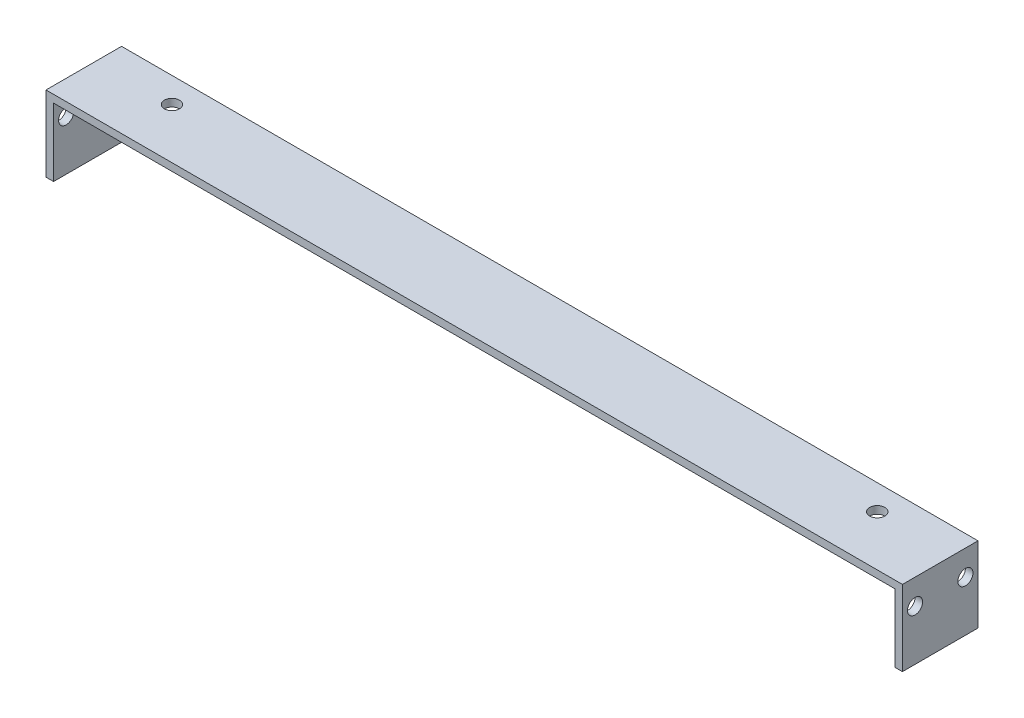
ISO-10303-21;
HEADER;
FILE_DESCRIPTION(('STEP AP214'),'2;1');
FILE_NAME('part.step','',(''),(''),'','','');
FILE_SCHEMA(('AUTOMOTIVE_DESIGN { 1 0 10303 214 1 1 1 1 }'));
ENDSEC;
DATA;
#1=APPLICATION_CONTEXT('core data for automotive mechanical design processes');
#2=APPLICATION_PROTOCOL_DEFINITION('international standard','automotive_design',2000,#1);
#3=PRODUCT_CONTEXT('',#1,'mechanical');
#4=PRODUCT('Part','Part','',(#3));
#5=PRODUCT_RELATED_PRODUCT_CATEGORY('part','',(#4));
#6=PRODUCT_DEFINITION_FORMATION('','',#4);
#7=PRODUCT_DEFINITION_CONTEXT('part definition',#1,'design');
#8=PRODUCT_DEFINITION('design','',#6,#7);
#9=PRODUCT_DEFINITION_SHAPE('','',#8);
#10=(LENGTH_UNIT() NAMED_UNIT(*) SI_UNIT(.MILLI.,.METRE.));
#11=(NAMED_UNIT(*) PLANE_ANGLE_UNIT() SI_UNIT($,.RADIAN.));
#12=(NAMED_UNIT(*) SI_UNIT($,.STERADIAN.) SOLID_ANGLE_UNIT());
#13=UNCERTAINTY_MEASURE_WITH_UNIT(LENGTH_MEASURE(1.E-05),#10,'distance_accuracy_value','');
#14=(GEOMETRIC_REPRESENTATION_CONTEXT(3) GLOBAL_UNCERTAINTY_ASSIGNED_CONTEXT((#13)) GLOBAL_UNIT_ASSIGNED_CONTEXT((#10,
#11,#12)) REPRESENTATION_CONTEXT('',''));
#15=CARTESIAN_POINT('',(0.,0.,0.));
#16=DIRECTION('',(0.,0.,1.));
#17=DIRECTION('',(1.,0.,0.));
#18=AXIS2_PLACEMENT_3D('',#15,#16,#17);
#19=CARTESIAN_POINT('',(0.,1.5,0.));
#20=DIRECTION('',(0.,-1.,0.));
#21=DIRECTION('',(0.,0.,-1.));
#22=AXIS2_PLACEMENT_3D('',#19,#20,#21);
#23=PLANE('',#22);
#24=CARTESIAN_POINT('',(13.5,1.50000000000006,-10.));
#25=DIRECTION('',(0.,-1.,0.));
#26=DIRECTION('',(0.,0.,-1.));
#27=AXIS2_PLACEMENT_3D('',#24,#25,#26);
#28=CIRCLE('',#27,1.5);
#29=CARTESIAN_POINT('',(13.5,1.50000000000006,-11.5));
#30=VERTEX_POINT('',#29);
#31=EDGE_CURVE('E262',#30,#30,#28,.F.);
#32=ORIENTED_EDGE('',*,*,#31,.F.);
#33=EDGE_LOOP('',(#32));
#34=FACE_BOUND('',#33,.T.);
#35=DIRECTION('',(-1.,0.,0.));
#36=VECTOR('',#35,1.);
#37=CARTESIAN_POINT('',(0.,1.5,-15.));
#38=LINE('',#37,#36);
#39=CARTESIAN_POINT('',(168.5,1.5,-15.));
#40=VERTEX_POINT('',#39);
#41=CARTESIAN_POINT('',(-1.5,1.5,-15.));
#42=VERTEX_POINT('',#41);
#43=EDGE_CURVE('E11',#40,#42,#38,.T.);
#44=ORIENTED_EDGE('',*,*,#43,.T.);
#45=DIRECTION('',(0.,0.,-1.));
#46=VECTOR('',#45,1.);
#47=CARTESIAN_POINT('',(-1.5,1.5,0.));
#48=LINE('',#47,#46);
#49=CARTESIAN_POINT('',(-1.5,1.5,0.));
#50=VERTEX_POINT('',#49);
#51=EDGE_CURVE('E110',#50,#42,#48,.T.);
#52=ORIENTED_EDGE('',*,*,#51,.F.);
#53=DIRECTION('',(1.,0.,0.));
#54=VECTOR('',#53,1.);
#55=CARTESIAN_POINT('',(0.,1.5,0.));
#56=LINE('',#55,#54);
#57=CARTESIAN_POINT('',(168.5,1.5,0.));
#58=VERTEX_POINT('',#57);
#59=EDGE_CURVE('E42',#50,#58,#56,.T.);
#60=ORIENTED_EDGE('',*,*,#59,.T.);
#61=DIRECTION('',(0.,0.,1.));
#62=VECTOR('',#61,1.);
#63=CARTESIAN_POINT('',(168.5,1.5,0.));
#64=LINE('',#63,#62);
#65=EDGE_CURVE('E149',#40,#58,#64,.T.);
#66=ORIENTED_EDGE('',*,*,#65,.F.);
#67=EDGE_LOOP('',(#44,#52,#60,#66));
#68=FACE_BOUND('',#67,.T.);
#69=CARTESIAN_POINT('',(153.5,1.50000000000006,-10.));
#70=DIRECTION('',(0.,-1.,0.));
#71=DIRECTION('',(0.,0.,-1.));
#72=AXIS2_PLACEMENT_3D('',#69,#70,#71);
#73=CIRCLE('',#72,1.5);
#74=CARTESIAN_POINT('',(153.5,1.50000000000006,-11.5));
#75=VERTEX_POINT('',#74);
#76=EDGE_CURVE('E258',#75,#75,#73,.F.);
#77=ORIENTED_EDGE('',*,*,#76,.F.);
#78=EDGE_LOOP('',(#77));
#79=FACE_BOUND('',#78,.T.);
#80=ADVANCED_FACE('F33',(#34,#68,#79),#23,.F.);
#81=CARTESIAN_POINT('',(0.,0.,0.));
#82=DIRECTION('',(0.,-1.,0.));
#83=DIRECTION('',(0.,0.,-1.));
#84=AXIS2_PLACEMENT_3D('',#81,#82,#83);
#85=PLANE('',#84);
#86=CARTESIAN_POINT('',(13.5,0.,-10.));
#87=DIRECTION('',(0.,-1.,0.));
#88=DIRECTION('',(0.,0.,-1.));
#89=AXIS2_PLACEMENT_3D('',#86,#87,#88);
#90=CIRCLE('',#89,1.5);
#91=CARTESIAN_POINT('',(13.5,0.,-11.5));
#92=VERTEX_POINT('',#91);
#93=EDGE_CURVE('E259',#92,#92,#90,.F.);
#94=ORIENTED_EDGE('',*,*,#93,.T.);
#95=EDGE_LOOP('',(#94));
#96=FACE_BOUND('',#95,.T.);
#97=DIRECTION('',(0.,0.,1.));
#98=VECTOR('',#97,1.);
#99=CARTESIAN_POINT('',(0.,0.,0.));
#100=LINE('',#99,#98);
#101=CARTESIAN_POINT('',(0.,0.,-15.));
#102=VERTEX_POINT('',#101);
#103=CARTESIAN_POINT('',(0.,0.,0.));
#104=VERTEX_POINT('',#103);
#105=EDGE_CURVE('E168',#102,#104,#100,.T.);
#106=ORIENTED_EDGE('',*,*,#105,.F.);
#107=DIRECTION('',(-1.,0.,0.));
#108=VECTOR('',#107,1.);
#109=CARTESIAN_POINT('',(0.,0.,-15.));
#110=LINE('',#109,#108);
#111=CARTESIAN_POINT('',(167.,0.,-15.));
#112=VERTEX_POINT('',#111);
#113=EDGE_CURVE('E50',#112,#102,#110,.T.);
#114=ORIENTED_EDGE('',*,*,#113,.F.);
#115=DIRECTION('',(0.,0.,-1.));
#116=VECTOR('',#115,1.);
#117=CARTESIAN_POINT('',(167.,0.,0.));
#118=LINE('',#117,#116);
#119=CARTESIAN_POINT('',(167.,0.,0.));
#120=VERTEX_POINT('',#119);
#121=EDGE_CURVE('E175',#120,#112,#118,.T.);
#122=ORIENTED_EDGE('',*,*,#121,.F.);
#123=DIRECTION('',(1.,0.,0.));
#124=VECTOR('',#123,1.);
#125=CARTESIAN_POINT('',(0.,0.,0.));
#126=LINE('',#125,#124);
#127=EDGE_CURVE('E58',#104,#120,#126,.T.);
#128=ORIENTED_EDGE('',*,*,#127,.F.);
#129=EDGE_LOOP('',(#106,#114,#122,#128));
#130=FACE_BOUND('',#129,.T.);
#131=CARTESIAN_POINT('',(153.5,0.,-10.));
#132=DIRECTION('',(0.,-1.,0.));
#133=DIRECTION('',(0.,0.,-1.));
#134=AXIS2_PLACEMENT_3D('',#131,#132,#133);
#135=CIRCLE('',#134,1.5);
#136=CARTESIAN_POINT('',(153.5,0.,-11.5));
#137=VERTEX_POINT('',#136);
#138=EDGE_CURVE('E37',#137,#137,#135,.F.);
#139=ORIENTED_EDGE('',*,*,#138,.T.);
#140=EDGE_LOOP('',(#139));
#141=FACE_BOUND('',#140,.T.);
#142=ADVANCED_FACE('F209',(#96,#130,#141),#85,.T.);
#143=CARTESIAN_POINT('',(167.,0.,0.));
#144=DIRECTION('',(1.,0.,0.));
#145=DIRECTION('',(0.,0.,-1.));
#146=AXIS2_PLACEMENT_3D('',#143,#144,#145);
#147=PLANE('',#146);
#148=CARTESIAN_POINT('',(167.,-3.5,-2.5));
#149=DIRECTION('',(1.,0.,0.));
#150=DIRECTION('',(0.,0.,-1.));
#151=AXIS2_PLACEMENT_3D('',#148,#149,#150);
#152=CIRCLE('',#151,1.5);
#153=CARTESIAN_POINT('',(167.,-3.5,-4.));
#154=VERTEX_POINT('',#153);
#155=EDGE_CURVE('E126',#154,#154,#152,.F.);
#156=ORIENTED_EDGE('',*,*,#155,.F.);
#157=EDGE_LOOP('',(#156));
#158=FACE_BOUND('',#157,.T.);
#159=DIRECTION('',(0.,-1.,0.));
#160=VECTOR('',#159,1.);
#161=CARTESIAN_POINT('',(167.,1.5,0.));
#162=LINE('',#161,#160);
#163=CARTESIAN_POINT('',(167.,-13.5,0.));
#164=VERTEX_POINT('',#163);
#165=EDGE_CURVE('E157',#120,#164,#162,.T.);
#166=ORIENTED_EDGE('',*,*,#165,.F.);
#167=ORIENTED_EDGE('',*,*,#121,.T.);
#168=DIRECTION('',(0.,1.,0.));
#169=VECTOR('',#168,1.);
#170=CARTESIAN_POINT('',(167.,1.5,-15.));
#171=LINE('',#170,#169);
#172=CARTESIAN_POINT('',(167.,-13.5,-15.));
#173=VERTEX_POINT('',#172);
#174=EDGE_CURVE('E144',#173,#112,#171,.T.);
#175=ORIENTED_EDGE('',*,*,#174,.F.);
#176=DIRECTION('',(0.,0.,-1.));
#177=VECTOR('',#176,1.);
#178=CARTESIAN_POINT('',(167.,-13.5,0.));
#179=LINE('',#178,#177);
#180=EDGE_CURVE('E154',#164,#173,#179,.T.);
#181=ORIENTED_EDGE('',*,*,#180,.F.);
#182=EDGE_LOOP('',(#166,#167,#175,#181));
#183=FACE_BOUND('',#182,.T.);
#184=CARTESIAN_POINT('',(167.,-3.5,-12.5));
#185=DIRECTION('',(1.,0.,0.));
#186=DIRECTION('',(0.,0.,-1.));
#187=AXIS2_PLACEMENT_3D('',#184,#185,#186);
#188=CIRCLE('',#187,1.5);
#189=CARTESIAN_POINT('',(167.,-3.5,-14.));
#190=VERTEX_POINT('',#189);
#191=EDGE_CURVE('E273',#190,#190,#188,.F.);
#192=ORIENTED_EDGE('',*,*,#191,.F.);
#193=EDGE_LOOP('',(#192));
#194=FACE_BOUND('',#193,.T.);
#195=ADVANCED_FACE('F193',(#158,#183,#194),#147,.F.);
#196=CARTESIAN_POINT('',(168.5,0.,0.));
#197=DIRECTION('',(1.,0.,0.));
#198=DIRECTION('',(0.,0.,-1.));
#199=AXIS2_PLACEMENT_3D('',#196,#197,#198);
#200=PLANE('',#199);
#201=CARTESIAN_POINT('',(168.5,-3.5,-2.5));
#202=DIRECTION('',(1.,0.,0.));
#203=DIRECTION('',(0.,0.,-1.));
#204=AXIS2_PLACEMENT_3D('',#201,#202,#203);
#205=CIRCLE('',#204,1.5);
#206=CARTESIAN_POINT('',(168.5,-3.5,-4.));
#207=VERTEX_POINT('',#206);
#208=EDGE_CURVE('E278',#207,#207,#205,.F.);
#209=ORIENTED_EDGE('',*,*,#208,.T.);
#210=EDGE_LOOP('',(#209));
#211=FACE_BOUND('',#210,.T.);
#212=DIRECTION('',(0.,-1.,0.));
#213=VECTOR('',#212,1.);
#214=CARTESIAN_POINT('',(168.5,1.5,0.));
#215=LINE('',#214,#213);
#216=CARTESIAN_POINT('',(168.5,-13.5,0.));
#217=VERTEX_POINT('',#216);
#218=EDGE_CURVE('E104',#58,#217,#215,.T.);
#219=ORIENTED_EDGE('',*,*,#218,.T.);
#220=DIRECTION('',(0.,0.,-1.));
#221=VECTOR('',#220,1.);
#222=CARTESIAN_POINT('',(168.5,-13.5,0.));
#223=LINE('',#222,#221);
#224=CARTESIAN_POINT('',(168.5,-13.5,-15.));
#225=VERTEX_POINT('',#224);
#226=EDGE_CURVE('E143',#217,#225,#223,.T.);
#227=ORIENTED_EDGE('',*,*,#226,.T.);
#228=DIRECTION('',(0.,1.,0.));
#229=VECTOR('',#228,1.);
#230=CARTESIAN_POINT('',(168.5,1.5,-15.));
#231=LINE('',#230,#229);
#232=EDGE_CURVE('E146',#225,#40,#231,.T.);
#233=ORIENTED_EDGE('',*,*,#232,.T.);
#234=ORIENTED_EDGE('',*,*,#65,.T.);
#235=EDGE_LOOP('',(#219,#227,#233,#234));
#236=FACE_BOUND('',#235,.T.);
#237=CARTESIAN_POINT('',(168.5,-3.5,-12.5));
#238=DIRECTION('',(1.,0.,0.));
#239=DIRECTION('',(0.,0.,-1.));
#240=AXIS2_PLACEMENT_3D('',#237,#238,#239);
#241=CIRCLE('',#240,1.5);
#242=CARTESIAN_POINT('',(168.5,-3.5,-14.));
#243=VERTEX_POINT('',#242);
#244=EDGE_CURVE('E270',#243,#243,#241,.F.);
#245=ORIENTED_EDGE('',*,*,#244,.T.);
#246=EDGE_LOOP('',(#245));
#247=FACE_BOUND('',#246,.T.);
#248=ADVANCED_FACE('F220',(#211,#236,#247),#200,.T.);
#249=CARTESIAN_POINT('',(-1.5,0.,0.));
#250=DIRECTION('',(1.,0.,0.));
#251=DIRECTION('',(0.,0.,-1.));
#252=AXIS2_PLACEMENT_3D('',#249,#250,#251);
#253=PLANE('',#252);
#254=CARTESIAN_POINT('',(-1.50000000000006,-3.5,-2.5));
#255=DIRECTION('',(1.,0.,0.));
#256=DIRECTION('',(0.,0.,-1.));
#257=AXIS2_PLACEMENT_3D('',#254,#255,#256);
#258=CIRCLE('',#257,1.5);
#259=CARTESIAN_POINT('',(-1.50000000000006,-3.5,-4.));
#260=VERTEX_POINT('',#259);
#261=EDGE_CURVE('E276',#260,#260,#258,.F.);
#262=ORIENTED_EDGE('',*,*,#261,.F.);
#263=EDGE_LOOP('',(#262));
#264=FACE_BOUND('',#263,.T.);
#265=DIRECTION('',(0.,1.,0.));
#266=VECTOR('',#265,1.);
#267=CARTESIAN_POINT('',(-1.5,1.5,0.));
#268=LINE('',#267,#266);
#269=CARTESIAN_POINT('',(-1.5,-13.5,0.));
#270=VERTEX_POINT('',#269);
#271=EDGE_CURVE('E101',#270,#50,#268,.T.);
#272=ORIENTED_EDGE('',*,*,#271,.T.);
#273=ORIENTED_EDGE('',*,*,#51,.T.);
#274=DIRECTION('',(0.,-1.,0.));
#275=VECTOR('',#274,1.);
#276=CARTESIAN_POINT('',(-1.5,1.5,-15.));
#277=LINE('',#276,#275);
#278=CARTESIAN_POINT('',(-1.5,-13.5,-15.));
#279=VERTEX_POINT('',#278);
#280=EDGE_CURVE('E114',#42,#279,#277,.T.);
#281=ORIENTED_EDGE('',*,*,#280,.T.);
#282=DIRECTION('',(0.,0.,1.));
#283=VECTOR('',#282,1.);
#284=CARTESIAN_POINT('',(-1.5,-13.5,0.));
#285=LINE('',#284,#283);
#286=EDGE_CURVE('E119',#279,#270,#285,.T.);
#287=ORIENTED_EDGE('',*,*,#286,.T.);
#288=EDGE_LOOP('',(#272,#273,#281,#287));
#289=FACE_BOUND('',#288,.T.);
#290=CARTESIAN_POINT('',(-1.50000000000006,-3.5,-12.5));
#291=DIRECTION('',(1.,0.,0.));
#292=DIRECTION('',(0.,0.,-1.));
#293=AXIS2_PLACEMENT_3D('',#290,#291,#292);
#294=CIRCLE('',#293,1.5);
#295=CARTESIAN_POINT('',(-1.50000000000006,-3.5,-14.));
#296=VERTEX_POINT('',#295);
#297=EDGE_CURVE('E267',#296,#296,#294,.F.);
#298=ORIENTED_EDGE('',*,*,#297,.F.);
#299=EDGE_LOOP('',(#298));
#300=FACE_BOUND('',#299,.T.);
#301=ADVANCED_FACE('F116',(#264,#289,#300),#253,.F.);
#302=CARTESIAN_POINT('',(0.,0.,0.));
#303=DIRECTION('',(1.,0.,0.));
#304=DIRECTION('',(0.,0.,-1.));
#305=AXIS2_PLACEMENT_3D('',#302,#303,#304);
#306=PLANE('',#305);
#307=CARTESIAN_POINT('',(0.,-3.5,-2.5));
#308=DIRECTION('',(1.,0.,0.));
#309=DIRECTION('',(0.,0.,-1.));
#310=AXIS2_PLACEMENT_3D('',#307,#308,#309);
#311=CIRCLE('',#310,1.5);
#312=CARTESIAN_POINT('',(0.,-3.5,-4.));
#313=VERTEX_POINT('',#312);
#314=EDGE_CURVE('E181',#313,#313,#311,.F.);
#315=ORIENTED_EDGE('',*,*,#314,.T.);
#316=EDGE_LOOP('',(#315));
#317=FACE_BOUND('',#316,.T.);
#318=DIRECTION('',(0.,-1.,0.));
#319=VECTOR('',#318,1.);
#320=CARTESIAN_POINT('',(0.,1.5,-15.));
#321=LINE('',#320,#319);
#322=CARTESIAN_POINT('',(0.,-13.5,-15.));
#323=VERTEX_POINT('',#322);
#324=EDGE_CURVE('E123',#102,#323,#321,.T.);
#325=ORIENTED_EDGE('',*,*,#324,.F.);
#326=ORIENTED_EDGE('',*,*,#105,.T.);
#327=DIRECTION('',(0.,1.,0.));
#328=VECTOR('',#327,1.);
#329=CARTESIAN_POINT('',(0.,1.5,0.));
#330=LINE('',#329,#328);
#331=CARTESIAN_POINT('',(0.,-13.5,0.));
#332=VERTEX_POINT('',#331);
#333=EDGE_CURVE('E136',#332,#104,#330,.T.);
#334=ORIENTED_EDGE('',*,*,#333,.F.);
#335=DIRECTION('',(0.,0.,1.));
#336=VECTOR('',#335,1.);
#337=CARTESIAN_POINT('',(0.,-13.5,0.));
#338=LINE('',#337,#336);
#339=EDGE_CURVE('E121',#323,#332,#338,.T.);
#340=ORIENTED_EDGE('',*,*,#339,.F.);
#341=EDGE_LOOP('',(#325,#326,#334,#340));
#342=FACE_BOUND('',#341,.T.);
#343=CARTESIAN_POINT('',(0.,-3.5,-12.5));
#344=DIRECTION('',(1.,0.,0.));
#345=DIRECTION('',(0.,0.,-1.));
#346=AXIS2_PLACEMENT_3D('',#343,#344,#345);
#347=CIRCLE('',#346,1.5);
#348=CARTESIAN_POINT('',(0.,-3.5,-14.));
#349=VERTEX_POINT('',#348);
#350=EDGE_CURVE('E266',#349,#349,#347,.F.);
#351=ORIENTED_EDGE('',*,*,#350,.T.);
#352=EDGE_LOOP('',(#351));
#353=FACE_BOUND('',#352,.T.);
#354=ADVANCED_FACE('F206',(#317,#342,#353),#306,.T.);
#355=CARTESIAN_POINT('',(0.,1.5,0.));
#356=DIRECTION('',(0.,0.,-1.));
#357=DIRECTION('',(-1.,0.,0.));
#358=AXIS2_PLACEMENT_3D('',#355,#356,#357);
#359=PLANE('',#358);
#360=ORIENTED_EDGE('',*,*,#127,.T.);
#361=ORIENTED_EDGE('',*,*,#165,.T.);
#362=DIRECTION('',(-1.,0.,0.));
#363=VECTOR('',#362,1.);
#364=CARTESIAN_POINT('',(168.5,-13.5,0.));
#365=LINE('',#364,#363);
#366=EDGE_CURVE('E160',#217,#164,#365,.T.);
#367=ORIENTED_EDGE('',*,*,#366,.F.);
#368=ORIENTED_EDGE('',*,*,#218,.F.);
#369=ORIENTED_EDGE('',*,*,#59,.F.);
#370=ORIENTED_EDGE('',*,*,#271,.F.);
#371=DIRECTION('',(1.,0.,0.));
#372=VECTOR('',#371,1.);
#373=CARTESIAN_POINT('',(-1.5,-13.5,0.));
#374=LINE('',#373,#372);
#375=EDGE_CURVE('E131',#270,#332,#374,.T.);
#376=ORIENTED_EDGE('',*,*,#375,.T.);
#377=ORIENTED_EDGE('',*,*,#333,.T.);
#378=EDGE_LOOP('',(#360,#361,#367,#368,#369,#370,#376,#377));
#379=FACE_BOUND('',#378,.T.);
#380=ADVANCED_FACE('F35',(#379),#359,.F.);
#381=CARTESIAN_POINT('',(0.,1.5,-15.));
#382=DIRECTION('',(0.,0.,1.));
#383=DIRECTION('',(1.,0.,0.));
#384=AXIS2_PLACEMENT_3D('',#381,#382,#383);
#385=PLANE('',#384);
#386=ORIENTED_EDGE('',*,*,#113,.T.);
#387=ORIENTED_EDGE('',*,*,#324,.T.);
#388=DIRECTION('',(1.,0.,0.));
#389=VECTOR('',#388,1.);
#390=CARTESIAN_POINT('',(-1.5,-13.5,-15.));
#391=LINE('',#390,#389);
#392=EDGE_CURVE('E139',#279,#323,#391,.T.);
#393=ORIENTED_EDGE('',*,*,#392,.F.);
#394=ORIENTED_EDGE('',*,*,#280,.F.);
#395=ORIENTED_EDGE('',*,*,#43,.F.);
#396=ORIENTED_EDGE('',*,*,#232,.F.);
#397=DIRECTION('',(-1.,0.,0.));
#398=VECTOR('',#397,1.);
#399=CARTESIAN_POINT('',(168.5,-13.5,-15.));
#400=LINE('',#399,#398);
#401=EDGE_CURVE('E151',#225,#173,#400,.T.);
#402=ORIENTED_EDGE('',*,*,#401,.T.);
#403=ORIENTED_EDGE('',*,*,#174,.T.);
#404=EDGE_LOOP('',(#386,#387,#393,#394,#395,#396,#402,#403));
#405=FACE_BOUND('',#404,.T.);
#406=ADVANCED_FACE('F197',(#405),#385,.F.);
#407=CARTESIAN_POINT('',(168.5,-13.5,0.));
#408=DIRECTION('',(0.,1.,0.));
#409=DIRECTION('',(0.,0.,1.));
#410=AXIS2_PLACEMENT_3D('',#407,#408,#409);
#411=PLANE('',#410);
#412=ORIENTED_EDGE('',*,*,#180,.T.);
#413=ORIENTED_EDGE('',*,*,#401,.F.);
#414=ORIENTED_EDGE('',*,*,#226,.F.);
#415=ORIENTED_EDGE('',*,*,#366,.T.);
#416=EDGE_LOOP('',(#412,#413,#414,#415));
#417=FACE_BOUND('',#416,.T.);
#418=ADVANCED_FACE('F199',(#417),#411,.F.);
#419=CARTESIAN_POINT('',(-1.5,-13.5,0.));
#420=DIRECTION('',(0.,1.,0.));
#421=DIRECTION('',(0.,0.,1.));
#422=AXIS2_PLACEMENT_3D('',#419,#420,#421);
#423=PLANE('',#422);
#424=ORIENTED_EDGE('',*,*,#339,.T.);
#425=ORIENTED_EDGE('',*,*,#375,.F.);
#426=ORIENTED_EDGE('',*,*,#286,.F.);
#427=ORIENTED_EDGE('',*,*,#392,.T.);
#428=EDGE_LOOP('',(#424,#425,#426,#427));
#429=FACE_BOUND('',#428,.T.);
#430=ADVANCED_FACE('F204',(#429),#423,.F.);
#431=CARTESIAN_POINT('',(1168.5,-3.5,-2.5));
#432=DIRECTION('',(-1.,0.,0.));
#433=DIRECTION('',(0.,0.,1.));
#434=AXIS2_PLACEMENT_3D('',#431,#432,#433);
#435=CYLINDRICAL_SURFACE('',#434,1.5);
#436=ORIENTED_EDGE('',*,*,#314,.F.);
#437=EDGE_LOOP('',(#436));
#438=FACE_BOUND('',#437,.T.);
#439=ORIENTED_EDGE('',*,*,#261,.T.);
#440=EDGE_LOOP('',(#439));
#441=FACE_BOUND('',#440,.T.);
#442=ADVANCED_FACE('F227',(#438,#441),#435,.F.);
#443=ORIENTED_EDGE('',*,*,#208,.F.);
#444=EDGE_LOOP('',(#443));
#445=FACE_BOUND('',#444,.T.);
#446=ORIENTED_EDGE('',*,*,#155,.T.);
#447=EDGE_LOOP('',(#446));
#448=FACE_BOUND('',#447,.T.);
#449=ADVANCED_FACE('F235',(#445,#448),#435,.F.);
#450=CARTESIAN_POINT('',(1168.5,-3.5,-12.5));
#451=DIRECTION('',(-1.,0.,0.));
#452=DIRECTION('',(0.,0.,1.));
#453=AXIS2_PLACEMENT_3D('',#450,#451,#452);
#454=CYLINDRICAL_SURFACE('',#453,1.5);
#455=ORIENTED_EDGE('',*,*,#350,.F.);
#456=EDGE_LOOP('',(#455));
#457=FACE_BOUND('',#456,.T.);
#458=ORIENTED_EDGE('',*,*,#297,.T.);
#459=EDGE_LOOP('',(#458));
#460=FACE_BOUND('',#459,.T.);
#461=ADVANCED_FACE('F238',(#457,#460),#454,.F.);
#462=ORIENTED_EDGE('',*,*,#244,.F.);
#463=EDGE_LOOP('',(#462));
#464=FACE_BOUND('',#463,.T.);
#465=ORIENTED_EDGE('',*,*,#191,.T.);
#466=EDGE_LOOP('',(#465));
#467=FACE_BOUND('',#466,.T.);
#468=ADVANCED_FACE('F240',(#464,#467),#454,.F.);
#469=CARTESIAN_POINT('',(13.5,10001.5,-10.));
#470=DIRECTION('',(0.,-1.,0.));
#471=DIRECTION('',(0.,0.,-1.));
#472=AXIS2_PLACEMENT_3D('',#469,#470,#471);
#473=CYLINDRICAL_SURFACE('',#472,1.5);
#474=ORIENTED_EDGE('',*,*,#93,.F.);
#475=EDGE_LOOP('',(#474));
#476=FACE_BOUND('',#475,.T.);
#477=ORIENTED_EDGE('',*,*,#31,.T.);
#478=EDGE_LOOP('',(#477));
#479=FACE_BOUND('',#478,.T.);
#480=ADVANCED_FACE('F243',(#476,#479),#473,.F.);
#481=CARTESIAN_POINT('',(153.5,10001.5,-10.));
#482=DIRECTION('',(0.,-1.,0.));
#483=DIRECTION('',(0.,0.,-1.));
#484=AXIS2_PLACEMENT_3D('',#481,#482,#483);
#485=CYLINDRICAL_SURFACE('',#484,1.5);
#486=ORIENTED_EDGE('',*,*,#138,.F.);
#487=EDGE_LOOP('',(#486));
#488=FACE_BOUND('',#487,.T.);
#489=ORIENTED_EDGE('',*,*,#76,.T.);
#490=EDGE_LOOP('',(#489));
#491=FACE_BOUND('',#490,.T.);
#492=ADVANCED_FACE('F247',(#488,#491),#485,.F.);
#493=CLOSED_SHELL('',(#80,#142,#195,#248,#301,#354,#380,#406,#418,#430,#442,#449,#461,#468,#480,#492));
#494=MANIFOLD_SOLID_BREP('B2',#493);
#495=ADVANCED_BREP_SHAPE_REPRESENTATION('',(#18,#494),#14);
#496=SHAPE_DEFINITION_REPRESENTATION(#9,#495);
ENDSEC;
END-ISO-10303-21;
